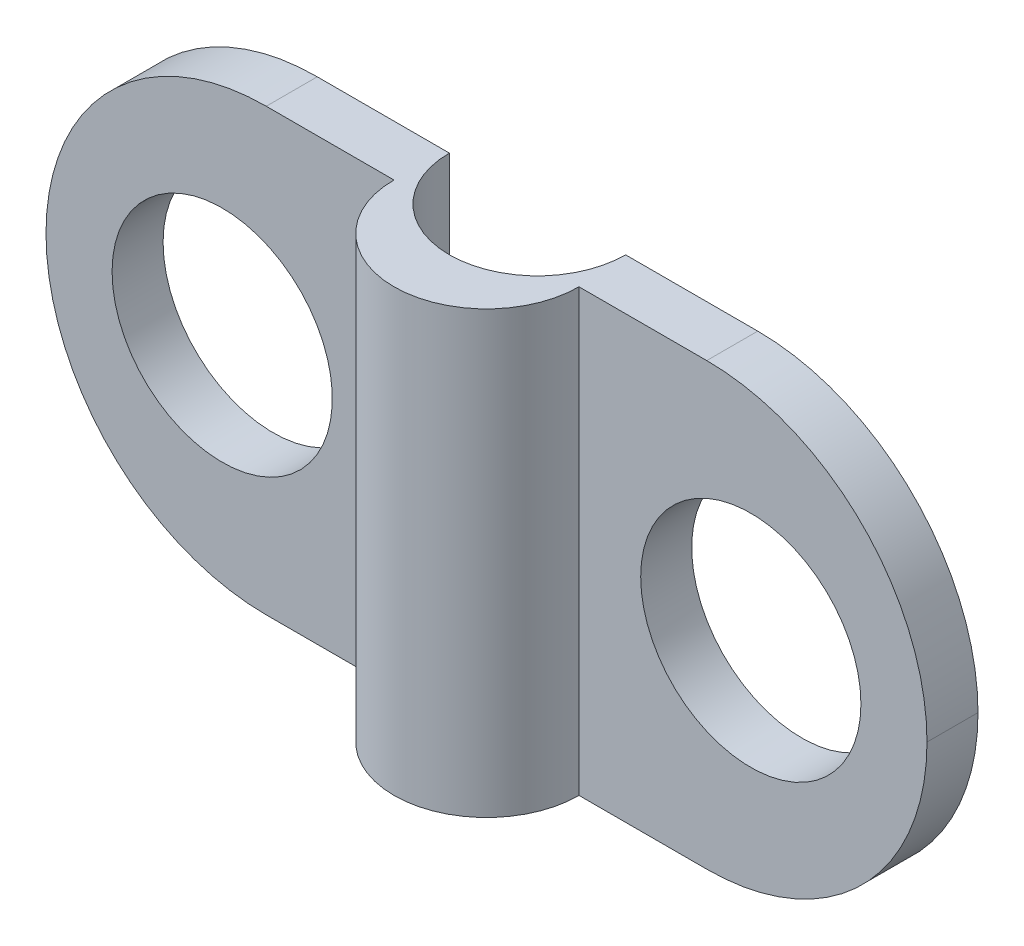
ISO-10303-21;
HEADER;
FILE_DESCRIPTION(('STEP AP214'),'2;1');
FILE_NAME('part.step','',(''),(''),'','','');
FILE_SCHEMA(('AUTOMOTIVE_DESIGN { 1 0 10303 214 1 1 1 1 }'));
ENDSEC;
DATA;
#1=APPLICATION_CONTEXT('core data for automotive mechanical design processes');
#2=APPLICATION_PROTOCOL_DEFINITION('international standard','automotive_design',2000,#1);
#3=PRODUCT_CONTEXT('',#1,'mechanical');
#4=PRODUCT('Part','Part','',(#3));
#5=PRODUCT_RELATED_PRODUCT_CATEGORY('part','',(#4));
#6=PRODUCT_DEFINITION_FORMATION('','',#4);
#7=PRODUCT_DEFINITION_CONTEXT('part definition',#1,'design');
#8=PRODUCT_DEFINITION('design','',#6,#7);
#9=PRODUCT_DEFINITION_SHAPE('','',#8);
#10=(LENGTH_UNIT() NAMED_UNIT(*) SI_UNIT(.MILLI.,.METRE.));
#11=(NAMED_UNIT(*) PLANE_ANGLE_UNIT() SI_UNIT($,.RADIAN.));
#12=(NAMED_UNIT(*) SI_UNIT($,.STERADIAN.) SOLID_ANGLE_UNIT());
#13=UNCERTAINTY_MEASURE_WITH_UNIT(LENGTH_MEASURE(1.E-05),#10,'distance_accuracy_value','');
#14=(GEOMETRIC_REPRESENTATION_CONTEXT(3) GLOBAL_UNCERTAINTY_ASSIGNED_CONTEXT((#13)) GLOBAL_UNIT_ASSIGNED_CONTEXT((#10,
#11,#12)) REPRESENTATION_CONTEXT('',''));
#15=CARTESIAN_POINT('',(0.,0.,0.));
#16=DIRECTION('',(0.,0.,1.));
#17=DIRECTION('',(1.,0.,0.));
#18=AXIS2_PLACEMENT_3D('',#15,#16,#17);
#19=CARTESIAN_POINT('',(-6.,0.,0.));
#20=DIRECTION('',(0.,0.,1.));
#21=DIRECTION('',(1.,0.,0.));
#22=AXIS2_PLACEMENT_3D('',#19,#20,#21);
#23=CYLINDRICAL_SURFACE('',#22,2.5);
#24=CARTESIAN_POINT('',(-6.,0.,2.72968620734027));
#25=DIRECTION('',(0.,0.,-1.));
#26=DIRECTION('',(-1.,0.,0.));
#27=AXIS2_PLACEMENT_3D('',#24,#25,#26);
#28=CIRCLE('',#27,2.5);
#29=CARTESIAN_POINT('',(-8.5,0.,2.72968620734027));
#30=VERTEX_POINT('',#29);
#31=EDGE_CURVE('E168',#30,#30,#28,.F.);
#32=ORIENTED_EDGE('',*,*,#31,.T.);
#33=EDGE_LOOP('',(#32));
#34=FACE_BOUND('',#33,.T.);
#35=CARTESIAN_POINT('',(-6.,0.,1.57194427269634));
#36=DIRECTION('',(0.,0.,-1.));
#37=DIRECTION('',(-1.,0.,0.));
#38=AXIS2_PLACEMENT_3D('',#35,#36,#37);
#39=CIRCLE('',#38,2.5);
#40=CARTESIAN_POINT('',(-8.5,0.,1.57194427269634));
#41=VERTEX_POINT('',#40);
#42=EDGE_CURVE('E147',#41,#41,#39,.F.);
#43=ORIENTED_EDGE('',*,*,#42,.F.);
#44=EDGE_LOOP('',(#43));
#45=FACE_BOUND('',#44,.T.);
#46=ADVANCED_FACE('F33',(#34,#45),#23,.F.);
#47=CARTESIAN_POINT('',(-10.,5.,10.));
#48=DIRECTION('',(0.,-1.,0.));
#49=DIRECTION('',(0.,0.,-1.));
#50=AXIS2_PLACEMENT_3D('',#47,#48,#49);
#51=PLANE('',#50);
#52=DIRECTION('',(1.,0.,0.));
#53=VECTOR('',#52,1.);
#54=CARTESIAN_POINT('',(0.,5.,2.72968620734027));
#55=LINE('',#54,#53);
#56=CARTESIAN_POINT('',(2.1,5.,2.72968620734027));
#57=VERTEX_POINT('',#56);
#58=CARTESIAN_POINT('',(5.,5.,2.72968620734027));
#59=VERTEX_POINT('',#58);
#60=EDGE_CURVE('E155',#57,#59,#55,.T.);
#61=ORIENTED_EDGE('',*,*,#60,.T.);
#62=DIRECTION('',(0.,0.,-1.));
#63=VECTOR('',#62,1.);
#64=CARTESIAN_POINT('',(5.,5.,10.));
#65=LINE('',#64,#63);
#66=CARTESIAN_POINT('',(5.,5.,1.57194427269634));
#67=VERTEX_POINT('',#66);
#68=EDGE_CURVE('E182',#59,#67,#65,.T.);
#69=ORIENTED_EDGE('',*,*,#68,.T.);
#70=DIRECTION('',(-1.,0.,0.));
#71=VECTOR('',#70,1.);
#72=CARTESIAN_POINT('',(0.,5.,1.57194427269634));
#73=LINE('',#72,#71);
#74=CARTESIAN_POINT('',(2.,5.,1.57194427269634));
#75=VERTEX_POINT('',#74);
#76=EDGE_CURVE('E122',#67,#75,#73,.T.);
#77=ORIENTED_EDGE('',*,*,#76,.T.);
#78=CARTESIAN_POINT('',(0.,5.,1.57194427269634));
#79=DIRECTION('',(0.,-1.,0.));
#80=DIRECTION('',(0.,0.,-1.));
#81=AXIS2_PLACEMENT_3D('',#78,#79,#80);
#82=CIRCLE('',#81,2.);
#83=CARTESIAN_POINT('',(-2.,5.,1.57194427269634));
#84=VERTEX_POINT('',#83);
#85=EDGE_CURVE('E123',#84,#75,#82,.F.);
#86=ORIENTED_EDGE('',*,*,#85,.F.);
#87=DIRECTION('',(1.,0.,0.));
#88=VECTOR('',#87,1.);
#89=CARTESIAN_POINT('',(0.,5.,1.57194427269634));
#90=LINE('',#89,#88);
#91=CARTESIAN_POINT('',(-5.,5.,1.57194427269634));
#92=VERTEX_POINT('',#91);
#93=EDGE_CURVE('E110',#92,#84,#90,.T.);
#94=ORIENTED_EDGE('',*,*,#93,.F.);
#95=DIRECTION('',(0.,0.,-1.));
#96=VECTOR('',#95,1.);
#97=CARTESIAN_POINT('',(-5.,5.,10.));
#98=LINE('',#97,#96);
#99=CARTESIAN_POINT('',(-5.,5.,2.72968620734027));
#100=VERTEX_POINT('',#99);
#101=EDGE_CURVE('E176',#92,#100,#98,.F.);
#102=ORIENTED_EDGE('',*,*,#101,.T.);
#103=DIRECTION('',(1.,0.,0.));
#104=VECTOR('',#103,1.);
#105=CARTESIAN_POINT('',(0.,5.,2.72968620734027));
#106=LINE('',#105,#104);
#107=CARTESIAN_POINT('',(-2.1,5.,2.72968620734027));
#108=VERTEX_POINT('',#107);
#109=EDGE_CURVE('E149',#100,#108,#106,.T.);
#110=ORIENTED_EDGE('',*,*,#109,.T.);
#111=CARTESIAN_POINT('',(0.,5.,2.72968620734027));
#112=DIRECTION('',(0.,-1.,0.));
#113=DIRECTION('',(0.,0.,-1.));
#114=AXIS2_PLACEMENT_3D('',#111,#112,#113);
#115=CIRCLE('',#114,2.1);
#116=EDGE_CURVE('E151',#108,#57,#115,.F.);
#117=ORIENTED_EDGE('',*,*,#116,.T.);
#118=EDGE_LOOP('',(#61,#69,#77,#86,#94,#102,#110,#117));
#119=FACE_BOUND('',#118,.T.);
#120=ADVANCED_FACE('F135',(#119),#51,.F.);
#121=CARTESIAN_POINT('',(-10.,-5.,10.));
#122=DIRECTION('',(0.,1.,0.));
#123=DIRECTION('',(0.,0.,1.));
#124=AXIS2_PLACEMENT_3D('',#121,#122,#123);
#125=PLANE('',#124);
#126=DIRECTION('',(-1.,0.,0.));
#127=VECTOR('',#126,1.);
#128=CARTESIAN_POINT('',(0.,-5.,1.57194427269634));
#129=LINE('',#128,#127);
#130=CARTESIAN_POINT('',(5.,-5.,1.57194427269634));
#131=VERTEX_POINT('',#130);
#132=CARTESIAN_POINT('',(2.,-5.,1.57194427269634));
#133=VERTEX_POINT('',#132);
#134=EDGE_CURVE('E138',#131,#133,#129,.T.);
#135=ORIENTED_EDGE('',*,*,#134,.F.);
#136=DIRECTION('',(0.,0.,-1.));
#137=VECTOR('',#136,1.);
#138=CARTESIAN_POINT('',(5.,-5.,10.));
#139=LINE('',#138,#137);
#140=CARTESIAN_POINT('',(5.,-5.,2.72968620734027));
#141=VERTEX_POINT('',#140);
#142=EDGE_CURVE('E194',#131,#141,#139,.F.);
#143=ORIENTED_EDGE('',*,*,#142,.T.);
#144=DIRECTION('',(1.,0.,0.));
#145=VECTOR('',#144,1.);
#146=CARTESIAN_POINT('',(0.,-5.,2.72968620734027));
#147=LINE('',#146,#145);
#148=CARTESIAN_POINT('',(2.1,-5.,2.72968620734027));
#149=VERTEX_POINT('',#148);
#150=EDGE_CURVE('E152',#149,#141,#147,.T.);
#151=ORIENTED_EDGE('',*,*,#150,.F.);
#152=CARTESIAN_POINT('',(0.,-5.,2.72968620734027));
#153=DIRECTION('',(0.,-1.,0.));
#154=DIRECTION('',(0.,0.,-1.));
#155=AXIS2_PLACEMENT_3D('',#152,#153,#154);
#156=CIRCLE('',#155,2.1);
#157=CARTESIAN_POINT('',(-2.1,-5.,2.72968620734027));
#158=VERTEX_POINT('',#157);
#159=EDGE_CURVE('E160',#158,#149,#156,.F.);
#160=ORIENTED_EDGE('',*,*,#159,.F.);
#161=DIRECTION('',(1.,0.,0.));
#162=VECTOR('',#161,1.);
#163=CARTESIAN_POINT('',(0.,-5.,2.72968620734027));
#164=LINE('',#163,#162);
#165=CARTESIAN_POINT('',(-5.,-5.,2.72968620734027));
#166=VERTEX_POINT('',#165);
#167=EDGE_CURVE('E158',#166,#158,#164,.T.);
#168=ORIENTED_EDGE('',*,*,#167,.F.);
#169=DIRECTION('',(0.,0.,-1.));
#170=VECTOR('',#169,1.);
#171=CARTESIAN_POINT('',(-5.,-5.,10.));
#172=LINE('',#171,#170);
#173=CARTESIAN_POINT('',(-5.,-5.,1.57194427269634));
#174=VERTEX_POINT('',#173);
#175=EDGE_CURVE('E192',#166,#174,#172,.T.);
#176=ORIENTED_EDGE('',*,*,#175,.T.);
#177=DIRECTION('',(1.,0.,0.));
#178=VECTOR('',#177,1.);
#179=CARTESIAN_POINT('',(0.,-5.,1.57194427269634));
#180=LINE('',#179,#178);
#181=CARTESIAN_POINT('',(-2.,-5.,1.57194427269634));
#182=VERTEX_POINT('',#181);
#183=EDGE_CURVE('E140',#174,#182,#180,.T.);
#184=ORIENTED_EDGE('',*,*,#183,.T.);
#185=CARTESIAN_POINT('',(0.,-5.,1.57194427269634));
#186=DIRECTION('',(0.,-1.,0.));
#187=DIRECTION('',(0.,0.,-1.));
#188=AXIS2_PLACEMENT_3D('',#185,#186,#187);
#189=CIRCLE('',#188,2.);
#190=EDGE_CURVE('E131',#182,#133,#189,.F.);
#191=ORIENTED_EDGE('',*,*,#190,.T.);
#192=EDGE_LOOP('',(#135,#143,#151,#160,#168,#176,#184,#191));
#193=FACE_BOUND('',#192,.T.);
#194=ADVANCED_FACE('F214',(#193),#125,.F.);
#195=CARTESIAN_POINT('',(6.,0.,0.));
#196=DIRECTION('',(0.,0.,1.));
#197=DIRECTION('',(1.,0.,0.));
#198=AXIS2_PLACEMENT_3D('',#195,#196,#197);
#199=CYLINDRICAL_SURFACE('',#198,2.5);
#200=CARTESIAN_POINT('',(6.,0.,1.57194427269634));
#201=DIRECTION('',(0.,0.,1.));
#202=DIRECTION('',(1.,0.,0.));
#203=AXIS2_PLACEMENT_3D('',#200,#201,#202);
#204=CIRCLE('',#203,2.5);
#205=CARTESIAN_POINT('',(8.5,0.,1.57194427269634));
#206=VERTEX_POINT('',#205);
#207=EDGE_CURVE('E161',#206,#206,#204,.F.);
#208=ORIENTED_EDGE('',*,*,#207,.T.);
#209=EDGE_LOOP('',(#208));
#210=FACE_BOUND('',#209,.T.);
#211=CARTESIAN_POINT('',(6.,0.,2.72968620734027));
#212=DIRECTION('',(0.,0.,-1.));
#213=DIRECTION('',(-1.,0.,0.));
#214=AXIS2_PLACEMENT_3D('',#211,#212,#213);
#215=CIRCLE('',#214,2.5);
#216=CARTESIAN_POINT('',(3.5,0.,2.72968620734027));
#217=VERTEX_POINT('',#216);
#218=EDGE_CURVE('E173',#217,#217,#215,.F.);
#219=ORIENTED_EDGE('',*,*,#218,.T.);
#220=EDGE_LOOP('',(#219));
#221=FACE_BOUND('',#220,.T.);
#222=ADVANCED_FACE('F234',(#210,#221),#199,.F.);
#223=CARTESIAN_POINT('',(0.,5.,2.72968620734027));
#224=DIRECTION('',(0.,0.,-1.));
#225=DIRECTION('',(-1.,0.,0.));
#226=AXIS2_PLACEMENT_3D('',#223,#224,#225);
#227=PLANE('',#226);
#228=CARTESIAN_POINT('',(5.,0.,2.72968620734027));
#229=DIRECTION('',(0.,0.,-1.));
#230=DIRECTION('',(-1.,0.,0.));
#231=AXIS2_PLACEMENT_3D('',#228,#229,#230);
#232=CIRCLE('',#231,5.);
#233=CARTESIAN_POINT('',(10.,0.,2.72968620734027));
#234=VERTEX_POINT('',#233);
#235=EDGE_CURVE('E188',#141,#234,#232,.F.);
#236=ORIENTED_EDGE('',*,*,#235,.T.);
#237=CARTESIAN_POINT('',(5.,0.,2.72968620734027));
#238=DIRECTION('',(0.,0.,-1.));
#239=DIRECTION('',(-1.,0.,0.));
#240=AXIS2_PLACEMENT_3D('',#237,#238,#239);
#241=CIRCLE('',#240,5.);
#242=EDGE_CURVE('E190',#234,#59,#241,.F.);
#243=ORIENTED_EDGE('',*,*,#242,.T.);
#244=ORIENTED_EDGE('',*,*,#60,.F.);
#245=DIRECTION('',(0.,-1.,0.));
#246=VECTOR('',#245,1.);
#247=CARTESIAN_POINT('',(2.1,5.,2.72968620734027));
#248=LINE('',#247,#246);
#249=EDGE_CURVE('E166',#57,#149,#248,.T.);
#250=ORIENTED_EDGE('',*,*,#249,.T.);
#251=ORIENTED_EDGE('',*,*,#150,.T.);
#252=EDGE_LOOP('',(#236,#243,#244,#250,#251));
#253=FACE_BOUND('',#252,.T.);
#254=ORIENTED_EDGE('',*,*,#218,.F.);
#255=EDGE_LOOP('',(#254));
#256=FACE_BOUND('',#255,.T.);
#257=ADVANCED_FACE('F231',(#253,#256),#227,.F.);
#258=CARTESIAN_POINT('',(0.,5.,2.72968620734027));
#259=DIRECTION('',(0.,0.,-1.));
#260=DIRECTION('',(-1.,0.,0.));
#261=AXIS2_PLACEMENT_3D('',#258,#259,#260);
#262=PLANE('',#261);
#263=ORIENTED_EDGE('',*,*,#109,.F.);
#264=CARTESIAN_POINT('',(-5.,0.,2.72968620734027));
#265=DIRECTION('',(0.,0.,-1.));
#266=DIRECTION('',(-1.,0.,0.));
#267=AXIS2_PLACEMENT_3D('',#264,#265,#266);
#268=CIRCLE('',#267,5.);
#269=CARTESIAN_POINT('',(-10.,0.,2.72968620734027));
#270=VERTEX_POINT('',#269);
#271=EDGE_CURVE('E11',#100,#270,#268,.F.);
#272=ORIENTED_EDGE('',*,*,#271,.T.);
#273=CARTESIAN_POINT('',(-5.,0.,2.72968620734027));
#274=DIRECTION('',(0.,0.,-1.));
#275=DIRECTION('',(-1.,0.,0.));
#276=AXIS2_PLACEMENT_3D('',#273,#274,#275);
#277=CIRCLE('',#276,5.);
#278=EDGE_CURVE('E42',#270,#166,#277,.F.);
#279=ORIENTED_EDGE('',*,*,#278,.T.);
#280=ORIENTED_EDGE('',*,*,#167,.T.);
#281=DIRECTION('',(0.,-1.,0.));
#282=VECTOR('',#281,1.);
#283=CARTESIAN_POINT('',(-2.1,5.,2.72968620734027));
#284=LINE('',#283,#282);
#285=EDGE_CURVE('E157',#108,#158,#284,.T.);
#286=ORIENTED_EDGE('',*,*,#285,.F.);
#287=EDGE_LOOP('',(#263,#272,#279,#280,#286));
#288=FACE_BOUND('',#287,.T.);
#289=ORIENTED_EDGE('',*,*,#31,.F.);
#290=EDGE_LOOP('',(#289));
#291=FACE_BOUND('',#290,.T.);
#292=ADVANCED_FACE('F208',(#288,#291),#262,.F.);
#293=CARTESIAN_POINT('',(0.,5.,2.72968620734027));
#294=DIRECTION('',(0.,-1.,0.));
#295=DIRECTION('',(0.,0.,-1.));
#296=AXIS2_PLACEMENT_3D('',#293,#294,#295);
#297=CYLINDRICAL_SURFACE('',#296,2.1);
#298=ORIENTED_EDGE('',*,*,#159,.T.);
#299=ORIENTED_EDGE('',*,*,#249,.F.);
#300=ORIENTED_EDGE('',*,*,#116,.F.);
#301=ORIENTED_EDGE('',*,*,#285,.T.);
#302=EDGE_LOOP('',(#298,#299,#300,#301));
#303=FACE_BOUND('',#302,.T.);
#304=ADVANCED_FACE('F217',(#303),#297,.T.);
#305=CARTESIAN_POINT('',(0.,5.,1.57194427269634));
#306=DIRECTION('',(0.,0.,1.));
#307=DIRECTION('',(1.,0.,0.));
#308=AXIS2_PLACEMENT_3D('',#305,#306,#307);
#309=PLANE('',#308);
#310=ORIENTED_EDGE('',*,*,#76,.F.);
#311=CARTESIAN_POINT('',(5.,0.,1.57194427269634));
#312=DIRECTION('',(0.,0.,1.));
#313=DIRECTION('',(1.,0.,0.));
#314=AXIS2_PLACEMENT_3D('',#311,#312,#313);
#315=CIRCLE('',#314,5.);
#316=CARTESIAN_POINT('',(10.,0.,1.57194427269634));
#317=VERTEX_POINT('',#316);
#318=EDGE_CURVE('E186',#67,#317,#315,.F.);
#319=ORIENTED_EDGE('',*,*,#318,.T.);
#320=CARTESIAN_POINT('',(5.,0.,1.57194427269634));
#321=DIRECTION('',(0.,0.,1.));
#322=DIRECTION('',(1.,0.,0.));
#323=AXIS2_PLACEMENT_3D('',#320,#321,#322);
#324=CIRCLE('',#323,5.);
#325=EDGE_CURVE('E184',#317,#131,#324,.F.);
#326=ORIENTED_EDGE('',*,*,#325,.T.);
#327=ORIENTED_EDGE('',*,*,#134,.T.);
#328=DIRECTION('',(0.,-1.,0.));
#329=VECTOR('',#328,1.);
#330=CARTESIAN_POINT('',(2.,5.,1.57194427269634));
#331=LINE('',#330,#329);
#332=EDGE_CURVE('E132',#75,#133,#331,.T.);
#333=ORIENTED_EDGE('',*,*,#332,.F.);
#334=EDGE_LOOP('',(#310,#319,#326,#327,#333));
#335=FACE_BOUND('',#334,.T.);
#336=ORIENTED_EDGE('',*,*,#207,.F.);
#337=EDGE_LOOP('',(#336));
#338=FACE_BOUND('',#337,.T.);
#339=ADVANCED_FACE('F225',(#335,#338),#309,.F.);
#340=CARTESIAN_POINT('',(0.,5.,1.57194427269634));
#341=DIRECTION('',(0.,0.,-1.));
#342=DIRECTION('',(-1.,0.,0.));
#343=AXIS2_PLACEMENT_3D('',#340,#341,#342);
#344=PLANE('',#343);
#345=CARTESIAN_POINT('',(-5.,0.,1.57194427269634));
#346=DIRECTION('',(0.,0.,-1.));
#347=DIRECTION('',(-1.,0.,0.));
#348=AXIS2_PLACEMENT_3D('',#345,#346,#347);
#349=CIRCLE('',#348,5.);
#350=CARTESIAN_POINT('',(-10.,0.,1.57194427269634));
#351=VERTEX_POINT('',#350);
#352=EDGE_CURVE('E56',#174,#351,#349,.T.);
#353=ORIENTED_EDGE('',*,*,#352,.T.);
#354=CARTESIAN_POINT('',(-5.,0.,1.57194427269634));
#355=DIRECTION('',(0.,0.,-1.));
#356=DIRECTION('',(-1.,0.,0.));
#357=AXIS2_PLACEMENT_3D('',#354,#355,#356);
#358=CIRCLE('',#357,5.);
#359=EDGE_CURVE('E117',#351,#92,#358,.T.);
#360=ORIENTED_EDGE('',*,*,#359,.T.);
#361=ORIENTED_EDGE('',*,*,#93,.T.);
#362=DIRECTION('',(0.,-1.,0.));
#363=VECTOR('',#362,1.);
#364=CARTESIAN_POINT('',(-2.,5.,1.57194427269634));
#365=LINE('',#364,#363);
#366=EDGE_CURVE('E114',#84,#182,#365,.T.);
#367=ORIENTED_EDGE('',*,*,#366,.T.);
#368=ORIENTED_EDGE('',*,*,#183,.F.);
#369=EDGE_LOOP('',(#353,#360,#361,#367,#368));
#370=FACE_BOUND('',#369,.T.);
#371=ORIENTED_EDGE('',*,*,#42,.T.);
#372=EDGE_LOOP('',(#371));
#373=FACE_BOUND('',#372,.T.);
#374=ADVANCED_FACE('F112',(#370,#373),#344,.T.);
#375=CARTESIAN_POINT('',(0.,5.,1.57194427269634));
#376=DIRECTION('',(0.,-1.,0.));
#377=DIRECTION('',(0.,0.,-1.));
#378=AXIS2_PLACEMENT_3D('',#375,#376,#377);
#379=CYLINDRICAL_SURFACE('',#378,2.);
#380=ORIENTED_EDGE('',*,*,#190,.F.);
#381=ORIENTED_EDGE('',*,*,#366,.F.);
#382=ORIENTED_EDGE('',*,*,#85,.T.);
#383=ORIENTED_EDGE('',*,*,#332,.T.);
#384=EDGE_LOOP('',(#380,#381,#382,#383));
#385=FACE_BOUND('',#384,.T.);
#386=ADVANCED_FACE('F127',(#385),#379,.F.);
#387=CARTESIAN_POINT('',(5.,0.,10.));
#388=DIRECTION('',(0.,0.,-1.));
#389=DIRECTION('',(-1.,0.,0.));
#390=AXIS2_PLACEMENT_3D('',#387,#388,#389);
#391=CYLINDRICAL_SURFACE('',#390,5.);
#392=DIRECTION('',(0.,0.,-1.));
#393=VECTOR('',#392,1.);
#394=CARTESIAN_POINT('',(10.,0.,10.));
#395=LINE('',#394,#393);
#396=EDGE_CURVE('E145',#234,#317,#395,.T.);
#397=ORIENTED_EDGE('',*,*,#396,.F.);
#398=ORIENTED_EDGE('',*,*,#235,.F.);
#399=ORIENTED_EDGE('',*,*,#142,.F.);
#400=ORIENTED_EDGE('',*,*,#325,.F.);
#401=EDGE_LOOP('',(#397,#398,#399,#400));
#402=FACE_BOUND('',#401,.T.);
#403=ADVANCED_FACE('F229',(#402),#391,.T.);
#404=CARTESIAN_POINT('',(5.,0.,10.));
#405=DIRECTION('',(0.,0.,-1.));
#406=DIRECTION('',(-1.,0.,0.));
#407=AXIS2_PLACEMENT_3D('',#404,#405,#406);
#408=CYLINDRICAL_SURFACE('',#407,5.);
#409=ORIENTED_EDGE('',*,*,#242,.F.);
#410=ORIENTED_EDGE('',*,*,#396,.T.);
#411=ORIENTED_EDGE('',*,*,#318,.F.);
#412=ORIENTED_EDGE('',*,*,#68,.F.);
#413=EDGE_LOOP('',(#409,#410,#411,#412));
#414=FACE_BOUND('',#413,.T.);
#415=ADVANCED_FACE('F222',(#414),#408,.T.);
#416=CARTESIAN_POINT('',(-5.,0.,10.));
#417=DIRECTION('',(0.,0.,-1.));
#418=DIRECTION('',(-1.,0.,0.));
#419=AXIS2_PLACEMENT_3D('',#416,#417,#418);
#420=CYLINDRICAL_SURFACE('',#419,5.);
#421=ORIENTED_EDGE('',*,*,#175,.F.);
#422=ORIENTED_EDGE('',*,*,#278,.F.);
#423=DIRECTION('',(0.,0.,-1.));
#424=VECTOR('',#423,1.);
#425=CARTESIAN_POINT('',(-10.,0.,10.));
#426=LINE('',#425,#424);
#427=EDGE_CURVE('E37',#351,#270,#426,.F.);
#428=ORIENTED_EDGE('',*,*,#427,.F.);
#429=ORIENTED_EDGE('',*,*,#352,.F.);
#430=EDGE_LOOP('',(#421,#422,#428,#429));
#431=FACE_BOUND('',#430,.T.);
#432=ADVANCED_FACE('F35',(#431),#420,.T.);
#433=CARTESIAN_POINT('',(-5.,0.,10.));
#434=DIRECTION('',(0.,0.,-1.));
#435=DIRECTION('',(-1.,0.,0.));
#436=AXIS2_PLACEMENT_3D('',#433,#434,#435);
#437=CYLINDRICAL_SURFACE('',#436,5.);
#438=ORIENTED_EDGE('',*,*,#271,.F.);
#439=ORIENTED_EDGE('',*,*,#101,.F.);
#440=ORIENTED_EDGE('',*,*,#359,.F.);
#441=ORIENTED_EDGE('',*,*,#427,.T.);
#442=EDGE_LOOP('',(#438,#439,#440,#441));
#443=FACE_BOUND('',#442,.T.);
#444=ADVANCED_FACE('F204',(#443),#437,.T.);
#445=CLOSED_SHELL('',(#46,#120,#194,#222,#257,#292,#304,#339,#374,#386,#403,#415,#432,#444));
#446=MANIFOLD_SOLID_BREP('B2',#445);
#447=ADVANCED_BREP_SHAPE_REPRESENTATION('',(#18,#446),#14);
#448=SHAPE_DEFINITION_REPRESENTATION(#9,#447);
ENDSEC;
END-ISO-10303-21;
